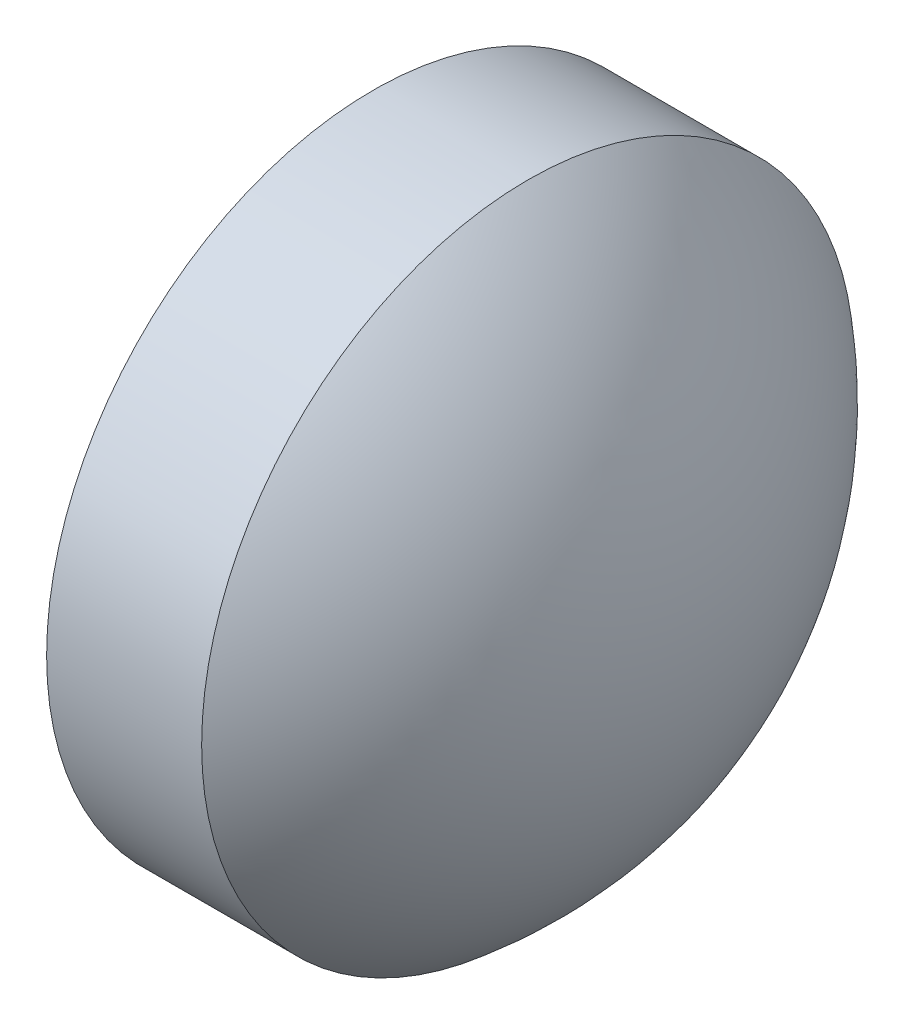
ISO-10303-21;
HEADER;
FILE_DESCRIPTION(('STEP AP214'),'2;1');
FILE_NAME('part.step','',(''),(''),'','','');
FILE_SCHEMA(('AUTOMOTIVE_DESIGN { 1 0 10303 214 1 1 1 1 }'));
ENDSEC;
DATA;
#1=APPLICATION_CONTEXT('core data for automotive mechanical design processes');
#2=APPLICATION_PROTOCOL_DEFINITION('international standard','automotive_design',2000,#1);
#3=PRODUCT_CONTEXT('',#1,'mechanical');
#4=PRODUCT('Part','Part','',(#3));
#5=PRODUCT_RELATED_PRODUCT_CATEGORY('part','',(#4));
#6=PRODUCT_DEFINITION_FORMATION('','',#4);
#7=PRODUCT_DEFINITION_CONTEXT('part definition',#1,'design');
#8=PRODUCT_DEFINITION('design','',#6,#7);
#9=PRODUCT_DEFINITION_SHAPE('','',#8);
#10=(LENGTH_UNIT() NAMED_UNIT(*) SI_UNIT(.MILLI.,.METRE.));
#11=(NAMED_UNIT(*) PLANE_ANGLE_UNIT() SI_UNIT($,.RADIAN.));
#12=(NAMED_UNIT(*) SI_UNIT($,.STERADIAN.) SOLID_ANGLE_UNIT());
#13=UNCERTAINTY_MEASURE_WITH_UNIT(LENGTH_MEASURE(1.E-05),#10,'distance_accuracy_value','');
#14=(GEOMETRIC_REPRESENTATION_CONTEXT(3) GLOBAL_UNCERTAINTY_ASSIGNED_CONTEXT((#13)) GLOBAL_UNIT_ASSIGNED_CONTEXT((#10,
#11,#12)) REPRESENTATION_CONTEXT('',''));
#15=CARTESIAN_POINT('',(0.,0.,0.));
#16=DIRECTION('',(0.,0.,1.));
#17=DIRECTION('',(1.,0.,0.));
#18=AXIS2_PLACEMENT_3D('',#15,#16,#17);
#19=CARTESIAN_POINT('',(423.428367263404,105.480616109672,0.));
#20=DIRECTION('',(-1.,0.,0.));
#21=DIRECTION('',(0.,0.,1.));
#22=AXIS2_PLACEMENT_3D('',#19,#20,#21);
#23=CYLINDRICAL_SURFACE('',#22,2.00000000000001);
#24=CARTESIAN_POINT('',(424.058339701774,105.480616109672,0.));
#25=DIRECTION('',(-1.,0.,0.));
#26=DIRECTION('',(0.,0.,1.));
#27=AXIS2_PLACEMENT_3D('',#24,#25,#26);
#28=CIRCLE('',#27,2.);
#29=CARTESIAN_POINT('',(424.058339701774,105.480616109672,2.));
#30=VERTEX_POINT('',#29);
#31=EDGE_CURVE('E10',#30,#30,#28,.T.);
#32=ORIENTED_EDGE('',*,*,#31,.F.);
#33=EDGE_LOOP('',(#32));
#34=FACE_BOUND('',#33,.T.);
#35=CARTESIAN_POINT('',(425.008339701774,105.480616109672,0.));
#36=DIRECTION('',(-1.,0.,0.));
#37=DIRECTION('',(0.,0.,1.));
#38=AXIS2_PLACEMENT_3D('',#35,#36,#37);
#39=CIRCLE('',#38,2.00000000000002);
#40=CARTESIAN_POINT('',(425.008339701774,105.480616109672,2.00000000000002));
#41=VERTEX_POINT('',#40);
#42=EDGE_CURVE('E41',#41,#41,#39,.T.);
#43=ORIENTED_EDGE('',*,*,#42,.T.);
#44=EDGE_LOOP('',(#43));
#45=FACE_BOUND('',#44,.T.);
#46=ADVANCED_FACE('F35',(#34,#45),#23,.T.);
#47=CARTESIAN_POINT('',(424.058339701774,107.480616109672,0.));
#48=DIRECTION('',(1.,0.,0.));
#49=DIRECTION('',(0.,0.,-1.));
#50=AXIS2_PLACEMENT_3D('',#47,#48,#49);
#51=PLANE('',#50);
#52=ORIENTED_EDGE('',*,*,#31,.T.);
#53=EDGE_LOOP('',(#52));
#54=FACE_BOUND('',#53,.T.);
#55=ADVANCED_FACE('F50',(#54),#51,.F.);
#56=CARTESIAN_POINT('',(423.378076590389,105.480616109672,0.));
#57=DIRECTION('',(-1.,0.,0.));
#58=DIRECTION('',(0.,1.,0.));
#59=AXIS2_PLACEMENT_3D('',#56,#57,#58);
#60=SPHERICAL_SURFACE('',#59,2.5802631285085);
#61=ORIENTED_EDGE('',*,*,#42,.F.);
#62=EDGE_LOOP('',(#61));
#63=FACE_BOUND('',#62,.T.);
#64=ADVANCED_FACE('F48',(#63),#60,.T.);
#65=CLOSED_SHELL('',(#46,#55,#64));
#66=MANIFOLD_SOLID_BREP('B2',#65);
#67=ADVANCED_BREP_SHAPE_REPRESENTATION('',(#18,#66),#14);
#68=SHAPE_DEFINITION_REPRESENTATION(#9,#67);
ENDSEC;
END-ISO-10303-21;
